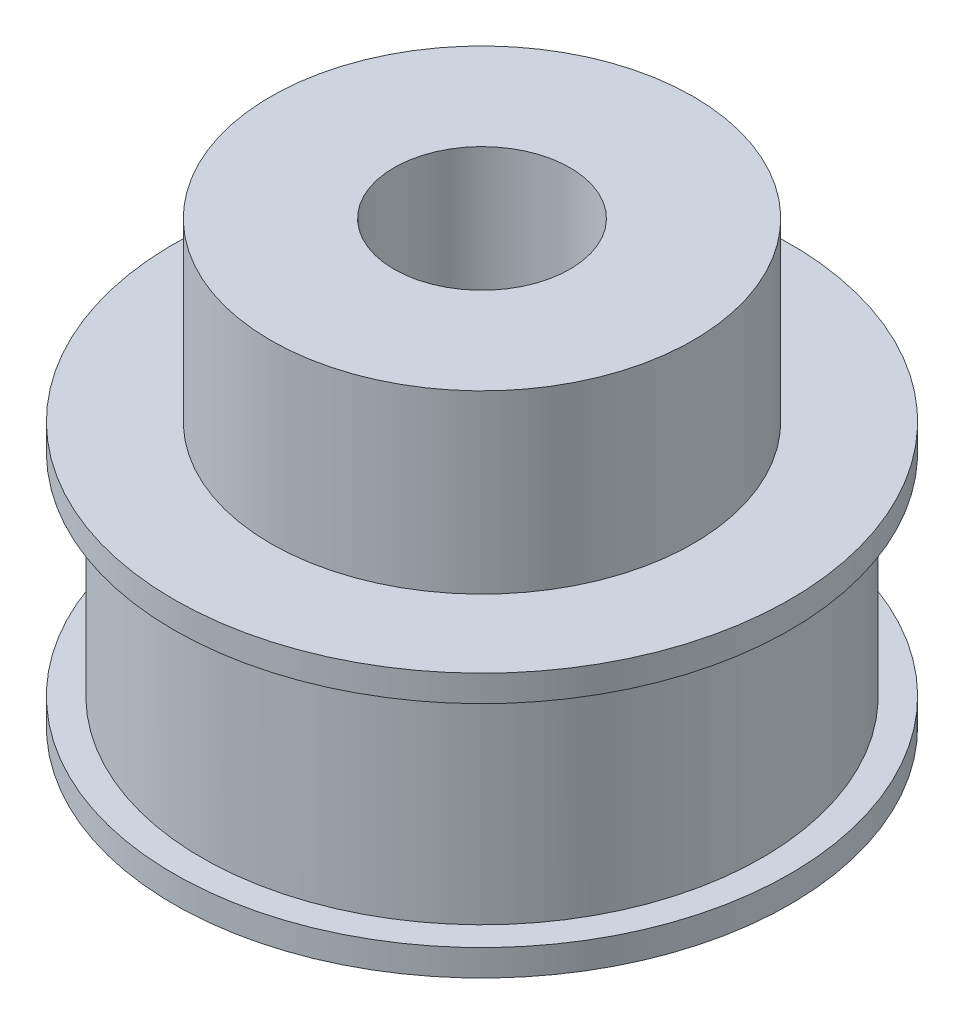
ISO-10303-21;
HEADER;
FILE_DESCRIPTION(('STEP AP214'),'2;1');
FILE_NAME('part.step','',(''),(''),'','','');
FILE_SCHEMA(('AUTOMOTIVE_DESIGN { 1 0 10303 214 1 1 1 1 }'));
ENDSEC;
DATA;
#1=APPLICATION_CONTEXT('core data for automotive mechanical design processes');
#2=APPLICATION_PROTOCOL_DEFINITION('international standard','automotive_design',2000,#1);
#3=PRODUCT_CONTEXT('',#1,'mechanical');
#4=PRODUCT('Part','Part','',(#3));
#5=PRODUCT_RELATED_PRODUCT_CATEGORY('part','',(#4));
#6=PRODUCT_DEFINITION_FORMATION('','',#4);
#7=PRODUCT_DEFINITION_CONTEXT('part definition',#1,'design');
#8=PRODUCT_DEFINITION('design','',#6,#7);
#9=PRODUCT_DEFINITION_SHAPE('','',#8);
#10=(LENGTH_UNIT() NAMED_UNIT(*) SI_UNIT(.MILLI.,.METRE.));
#11=(NAMED_UNIT(*) PLANE_ANGLE_UNIT() SI_UNIT($,.RADIAN.));
#12=(NAMED_UNIT(*) SI_UNIT($,.STERADIAN.) SOLID_ANGLE_UNIT());
#13=UNCERTAINTY_MEASURE_WITH_UNIT(LENGTH_MEASURE(1.E-05),#10,'distance_accuracy_value','');
#14=(GEOMETRIC_REPRESENTATION_CONTEXT(3) GLOBAL_UNCERTAINTY_ASSIGNED_CONTEXT((#13)) GLOBAL_UNIT_ASSIGNED_CONTEXT((#10,
#11,#12)) REPRESENTATION_CONTEXT('',''));
#15=CARTESIAN_POINT('',(0.,0.,0.));
#16=DIRECTION('',(0.,0.,1.));
#17=DIRECTION('',(1.,0.,0.));
#18=AXIS2_PLACEMENT_3D('',#15,#16,#17);
#19=CARTESIAN_POINT('',(0.,17.1918199233231,0.));
#20=DIRECTION('',(0.,-1.,0.));
#21=DIRECTION('',(0.,0.,-1.));
#22=AXIS2_PLACEMENT_3D('',#19,#20,#21);
#23=CYLINDRICAL_SURFACE('',#22,23.8725);
#24=CARTESIAN_POINT('',(0.,-3.05818007667692,0.));
#25=DIRECTION('',(0.,-1.,0.));
#26=DIRECTION('',(0.,0.,-1.));
#27=AXIS2_PLACEMENT_3D('',#24,#25,#26);
#28=CIRCLE('',#27,23.8725);
#29=CARTESIAN_POINT('',(0.,-3.05818007667692,-23.8725));
#30=VERTEX_POINT('',#29);
#31=EDGE_CURVE('E64',#30,#30,#28,.T.);
#32=ORIENTED_EDGE('',*,*,#31,.F.);
#33=EDGE_LOOP('',(#32));
#34=FACE_BOUND('',#33,.T.);
#35=CARTESIAN_POINT('',(0.,14.9418199233231,0.));
#36=DIRECTION('',(0.,1.,0.));
#37=DIRECTION('',(0.,0.,1.));
#38=AXIS2_PLACEMENT_3D('',#35,#36,#37);
#39=CIRCLE('',#38,23.8725);
#40=CARTESIAN_POINT('',(0.,14.9418199233231,23.8725));
#41=VERTEX_POINT('',#40);
#42=EDGE_CURVE('E76',#41,#41,#39,.T.);
#43=ORIENTED_EDGE('',*,*,#42,.F.);
#44=EDGE_LOOP('',(#43));
#45=FACE_BOUND('',#44,.T.);
#46=ADVANCED_FACE('F37',(#34,#45),#23,.T.);
#47=CARTESIAN_POINT('',(0.,17.1918199233231,0.));
#48=DIRECTION('',(0.,1.,0.));
#49=DIRECTION('',(0.,0.,1.));
#50=AXIS2_PLACEMENT_3D('',#47,#48,#49);
#51=PLANE('',#50);
#52=CARTESIAN_POINT('',(0.,17.1918199233231,0.));
#53=DIRECTION('',(0.,1.,0.));
#54=DIRECTION('',(0.,0.,1.));
#55=AXIS2_PLACEMENT_3D('',#52,#53,#54);
#56=CIRCLE('',#55,18.);
#57=CARTESIAN_POINT('',(0.,17.1918199233231,18.));
#58=VERTEX_POINT('',#57);
#59=EDGE_CURVE('E41',#58,#58,#56,.T.);
#60=ORIENTED_EDGE('',*,*,#59,.F.);
#61=EDGE_LOOP('',(#60));
#62=FACE_BOUND('',#61,.T.);
#63=CARTESIAN_POINT('',(0.,17.1918199233231,0.));
#64=DIRECTION('',(0.,1.,0.));
#65=DIRECTION('',(0.,0.,1.));
#66=AXIS2_PLACEMENT_3D('',#63,#64,#65);
#67=CIRCLE('',#66,26.25);
#68=CARTESIAN_POINT('',(0.,17.1918199233231,26.25));
#69=VERTEX_POINT('',#68);
#70=EDGE_CURVE('E72',#69,#69,#67,.T.);
#71=ORIENTED_EDGE('',*,*,#70,.T.);
#72=EDGE_LOOP('',(#71));
#73=FACE_BOUND('',#72,.T.);
#74=ADVANCED_FACE('F88',(#62,#73),#51,.T.);
#75=CARTESIAN_POINT('',(0.,-5.30818007667692,0.));
#76=DIRECTION('',(0.,1.,0.));
#77=DIRECTION('',(0.,0.,1.));
#78=AXIS2_PLACEMENT_3D('',#75,#76,#77);
#79=PLANE('',#78);
#80=CARTESIAN_POINT('',(0.,-5.30818007667692,0.));
#81=DIRECTION('',(0.,1.,0.));
#82=DIRECTION('',(0.,0.,1.));
#83=AXIS2_PLACEMENT_3D('',#80,#81,#82);
#84=CIRCLE('',#83,7.5);
#85=CARTESIAN_POINT('',(0.,-5.30818007667692,7.5));
#86=VERTEX_POINT('',#85);
#87=EDGE_CURVE('E50',#86,#86,#84,.T.);
#88=ORIENTED_EDGE('',*,*,#87,.T.);
#89=EDGE_LOOP('',(#88));
#90=FACE_BOUND('',#89,.T.);
#91=CARTESIAN_POINT('',(0.,-5.30818007667692,0.));
#92=DIRECTION('',(0.,-1.,0.));
#93=DIRECTION('',(0.,0.,-1.));
#94=AXIS2_PLACEMENT_3D('',#91,#92,#93);
#95=CIRCLE('',#94,26.25);
#96=CARTESIAN_POINT('',(0.,-5.30818007667692,-26.25));
#97=VERTEX_POINT('',#96);
#98=EDGE_CURVE('E60',#97,#97,#95,.T.);
#99=ORIENTED_EDGE('',*,*,#98,.T.);
#100=EDGE_LOOP('',(#99));
#101=FACE_BOUND('',#100,.T.);
#102=ADVANCED_FACE('F39',(#90,#101),#79,.F.);
#103=CARTESIAN_POINT('',(0.,32.1918199233231,0.));
#104=DIRECTION('',(0.,-1.,0.));
#105=DIRECTION('',(0.,0.,-1.));
#106=AXIS2_PLACEMENT_3D('',#103,#104,#105);
#107=CYLINDRICAL_SURFACE('',#106,18.);
#108=CARTESIAN_POINT('',(0.,32.1918199233231,0.));
#109=DIRECTION('',(0.,1.,0.));
#110=DIRECTION('',(0.,0.,1.));
#111=AXIS2_PLACEMENT_3D('',#108,#109,#110);
#112=CIRCLE('',#111,18.);
#113=CARTESIAN_POINT('',(0.,32.1918199233231,18.));
#114=VERTEX_POINT('',#113);
#115=EDGE_CURVE('E10',#114,#114,#112,.T.);
#116=ORIENTED_EDGE('',*,*,#115,.F.);
#117=EDGE_LOOP('',(#116));
#118=FACE_BOUND('',#117,.T.);
#119=ORIENTED_EDGE('',*,*,#59,.T.);
#120=EDGE_LOOP('',(#119));
#121=FACE_BOUND('',#120,.T.);
#122=ADVANCED_FACE('F107',(#118,#121),#107,.T.);
#123=CARTESIAN_POINT('',(0.,32.1918199233231,0.));
#124=DIRECTION('',(0.,1.,0.));
#125=DIRECTION('',(0.,0.,1.));
#126=AXIS2_PLACEMENT_3D('',#123,#124,#125);
#127=PLANE('',#126);
#128=CARTESIAN_POINT('',(0.,32.1918199233231,0.));
#129=DIRECTION('',(0.,1.,0.));
#130=DIRECTION('',(0.,0.,1.));
#131=AXIS2_PLACEMENT_3D('',#128,#129,#130);
#132=CIRCLE('',#131,7.5);
#133=CARTESIAN_POINT('',(0.,32.1918199233231,7.5));
#134=VERTEX_POINT('',#133);
#135=EDGE_CURVE('E55',#134,#134,#132,.T.);
#136=ORIENTED_EDGE('',*,*,#135,.F.);
#137=EDGE_LOOP('',(#136));
#138=FACE_BOUND('',#137,.T.);
#139=ORIENTED_EDGE('',*,*,#115,.T.);
#140=EDGE_LOOP('',(#139));
#141=FACE_BOUND('',#140,.T.);
#142=ADVANCED_FACE('F103',(#138,#141),#127,.T.);
#143=CARTESIAN_POINT('',(0.,-6.80818007667691,0.));
#144=DIRECTION('',(0.,1.,0.));
#145=DIRECTION('',(0.,0.,1.));
#146=AXIS2_PLACEMENT_3D('',#143,#144,#145);
#147=CYLINDRICAL_SURFACE('',#146,7.5);
#148=ORIENTED_EDGE('',*,*,#135,.T.);
#149=EDGE_LOOP('',(#148));
#150=FACE_BOUND('',#149,.T.);
#151=ORIENTED_EDGE('',*,*,#87,.F.);
#152=EDGE_LOOP('',(#151));
#153=FACE_BOUND('',#152,.T.);
#154=ADVANCED_FACE('F100',(#150,#153),#147,.F.);
#155=CARTESIAN_POINT('',(0.,-3.05818007667692,0.));
#156=DIRECTION('',(0.,-1.,0.));
#157=DIRECTION('',(0.,0.,-1.));
#158=AXIS2_PLACEMENT_3D('',#155,#156,#157);
#159=CYLINDRICAL_SURFACE('',#158,26.25);
#160=CARTESIAN_POINT('',(0.,-3.05818007667692,0.));
#161=DIRECTION('',(0.,-1.,0.));
#162=DIRECTION('',(0.,0.,-1.));
#163=AXIS2_PLACEMENT_3D('',#160,#161,#162);
#164=CIRCLE('',#163,26.25);
#165=CARTESIAN_POINT('',(0.,-3.05818007667692,-26.25));
#166=VERTEX_POINT('',#165);
#167=EDGE_CURVE('E59',#166,#166,#164,.T.);
#168=ORIENTED_EDGE('',*,*,#167,.T.);
#169=EDGE_LOOP('',(#168));
#170=FACE_BOUND('',#169,.T.);
#171=ORIENTED_EDGE('',*,*,#98,.F.);
#172=EDGE_LOOP('',(#171));
#173=FACE_BOUND('',#172,.T.);
#174=ADVANCED_FACE('F98',(#170,#173),#159,.T.);
#175=CARTESIAN_POINT('',(0.,-3.05818007667692,0.));
#176=DIRECTION('',(0.,-1.,0.));
#177=DIRECTION('',(0.,0.,-1.));
#178=AXIS2_PLACEMENT_3D('',#175,#176,#177);
#179=PLANE('',#178);
#180=ORIENTED_EDGE('',*,*,#31,.T.);
#181=EDGE_LOOP('',(#180));
#182=FACE_BOUND('',#181,.T.);
#183=ORIENTED_EDGE('',*,*,#167,.F.);
#184=EDGE_LOOP('',(#183));
#185=FACE_BOUND('',#184,.T.);
#186=ADVANCED_FACE('F122',(#182,#185),#179,.F.);
#187=CARTESIAN_POINT('',(0.,14.9418199233231,0.));
#188=DIRECTION('',(0.,1.,0.));
#189=DIRECTION('',(0.,0.,1.));
#190=AXIS2_PLACEMENT_3D('',#187,#188,#189);
#191=CYLINDRICAL_SURFACE('',#190,26.25);
#192=CARTESIAN_POINT('',(0.,14.9418199233231,0.));
#193=DIRECTION('',(0.,1.,0.));
#194=DIRECTION('',(0.,0.,1.));
#195=AXIS2_PLACEMENT_3D('',#192,#193,#194);
#196=CIRCLE('',#195,26.25);
#197=CARTESIAN_POINT('',(0.,14.9418199233231,26.25));
#198=VERTEX_POINT('',#197);
#199=EDGE_CURVE('E71',#198,#198,#196,.T.);
#200=ORIENTED_EDGE('',*,*,#199,.T.);
#201=EDGE_LOOP('',(#200));
#202=FACE_BOUND('',#201,.T.);
#203=ORIENTED_EDGE('',*,*,#70,.F.);
#204=EDGE_LOOP('',(#203));
#205=FACE_BOUND('',#204,.T.);
#206=ADVANCED_FACE('F120',(#202,#205),#191,.T.);
#207=CARTESIAN_POINT('',(0.,14.9418199233231,0.));
#208=DIRECTION('',(0.,1.,0.));
#209=DIRECTION('',(0.,0.,1.));
#210=AXIS2_PLACEMENT_3D('',#207,#208,#209);
#211=PLANE('',#210);
#212=ORIENTED_EDGE('',*,*,#42,.T.);
#213=EDGE_LOOP('',(#212));
#214=FACE_BOUND('',#213,.T.);
#215=ORIENTED_EDGE('',*,*,#199,.F.);
#216=EDGE_LOOP('',(#215));
#217=FACE_BOUND('',#216,.T.);
#218=ADVANCED_FACE('F84',(#214,#217),#211,.F.);
#219=CLOSED_SHELL('',(#46,#74,#102,#122,#142,#154,#174,#186,#206,#218));
#220=MANIFOLD_SOLID_BREP('B2',#219);
#221=ADVANCED_BREP_SHAPE_REPRESENTATION('',(#18,#220),#14);
#222=SHAPE_DEFINITION_REPRESENTATION(#9,#221);
ENDSEC;
END-ISO-10303-21;
